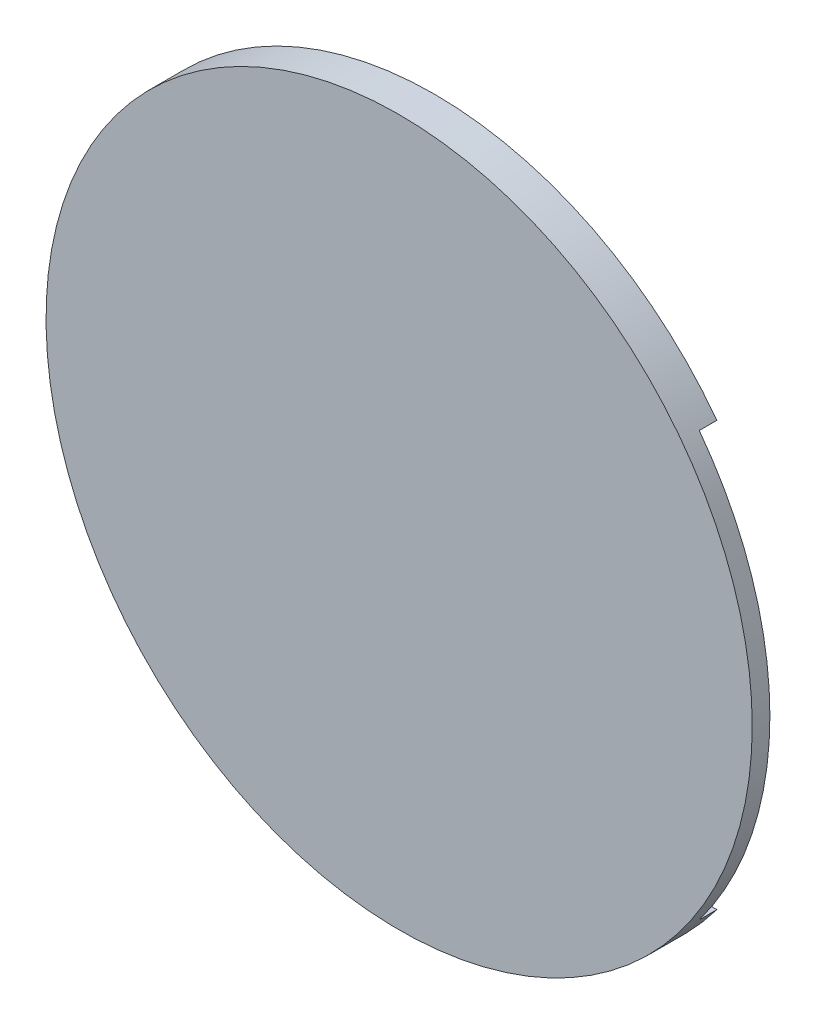
ISO-10303-21;
HEADER;
FILE_DESCRIPTION(('STEP AP214'),'2;1');
FILE_NAME('part.step','',(''),(''),'','','');
FILE_SCHEMA(('AUTOMOTIVE_DESIGN { 1 0 10303 214 1 1 1 1 }'));
ENDSEC;
DATA;
#1=APPLICATION_CONTEXT('core data for automotive mechanical design processes');
#2=APPLICATION_PROTOCOL_DEFINITION('international standard','automotive_design',2000,#1);
#3=PRODUCT_CONTEXT('',#1,'mechanical');
#4=PRODUCT('Part','Part','',(#3));
#5=PRODUCT_RELATED_PRODUCT_CATEGORY('part','',(#4));
#6=PRODUCT_DEFINITION_FORMATION('','',#4);
#7=PRODUCT_DEFINITION_CONTEXT('part definition',#1,'design');
#8=PRODUCT_DEFINITION('design','',#6,#7);
#9=PRODUCT_DEFINITION_SHAPE('','',#8);
#10=(LENGTH_UNIT() NAMED_UNIT(*) SI_UNIT(.MILLI.,.METRE.));
#11=(NAMED_UNIT(*) PLANE_ANGLE_UNIT() SI_UNIT($,.RADIAN.));
#12=(NAMED_UNIT(*) SI_UNIT($,.STERADIAN.) SOLID_ANGLE_UNIT());
#13=UNCERTAINTY_MEASURE_WITH_UNIT(LENGTH_MEASURE(1.E-05),#10,'distance_accuracy_value','');
#14=(GEOMETRIC_REPRESENTATION_CONTEXT(3) GLOBAL_UNCERTAINTY_ASSIGNED_CONTEXT((#13)) GLOBAL_UNIT_ASSIGNED_CONTEXT((#10,
#11,#12)) REPRESENTATION_CONTEXT('',''));
#15=CARTESIAN_POINT('',(0.,0.,0.));
#16=DIRECTION('',(0.,0.,1.));
#17=DIRECTION('',(1.,0.,0.));
#18=AXIS2_PLACEMENT_3D('',#15,#16,#17);
#19=CARTESIAN_POINT('',(0.,0.,1.5875));
#20=DIRECTION('',(0.,0.,-1.));
#21=DIRECTION('',(-1.,0.,0.));
#22=AXIS2_PLACEMENT_3D('',#19,#20,#21);
#23=CYLINDRICAL_SURFACE('',#22,31.75);
#24=CARTESIAN_POINT('',(0.,0.,1.5875));
#25=DIRECTION('',(0.,0.,1.));
#26=DIRECTION('',(1.,0.,0.));
#27=AXIS2_PLACEMENT_3D('',#24,#25,#26);
#28=CIRCLE('',#27,31.75);
#29=CARTESIAN_POINT('',(31.75,0.,1.5875));
#30=VERTEX_POINT('',#29);
#31=EDGE_CURVE('E83',#30,#30,#28,.T.);
#32=ORIENTED_EDGE('',*,*,#31,.F.);
#33=EDGE_LOOP('',(#32));
#34=FACE_BOUND('',#33,.T.);
#35=DIRECTION('',(0.,0.,-1.));
#36=VECTOR('',#35,1.);
#37=CARTESIAN_POINT('',(25.4,-19.05,1.5875));
#38=LINE('',#37,#36);
#39=CARTESIAN_POINT('',(25.4,-19.05,0.));
#40=VERTEX_POINT('',#39);
#41=CARTESIAN_POINT('',(25.4,-19.05,-1.5875));
#42=VERTEX_POINT('',#41);
#43=EDGE_CURVE('E57',#40,#42,#38,.T.);
#44=ORIENTED_EDGE('',*,*,#43,.F.);
#45=CARTESIAN_POINT('',(0.,0.,0.));
#46=DIRECTION('',(0.,0.,1.));
#47=DIRECTION('',(0.,-1.,0.));
#48=AXIS2_PLACEMENT_3D('',#45,#46,#47);
#49=CIRCLE('',#48,31.75);
#50=CARTESIAN_POINT('',(25.4,19.05,0.));
#51=VERTEX_POINT('',#50);
#52=EDGE_CURVE('E38',#40,#51,#49,.T.);
#53=ORIENTED_EDGE('',*,*,#52,.T.);
#54=DIRECTION('',(0.,0.,-1.));
#55=VECTOR('',#54,1.);
#56=CARTESIAN_POINT('',(25.4,19.05,1.5875));
#57=LINE('',#56,#55);
#58=CARTESIAN_POINT('',(25.4,19.05,-1.5875));
#59=VERTEX_POINT('',#58);
#60=EDGE_CURVE('E77',#51,#59,#57,.T.);
#61=ORIENTED_EDGE('',*,*,#60,.T.);
#62=CARTESIAN_POINT('',(0.,0.,-1.5875));
#63=DIRECTION('',(0.,0.,1.));
#64=DIRECTION('',(1.,0.,0.));
#65=AXIS2_PLACEMENT_3D('',#62,#63,#64);
#66=CIRCLE('',#65,31.75);
#67=CARTESIAN_POINT('',(-25.4,19.05,-1.5875));
#68=VERTEX_POINT('',#67);
#69=EDGE_CURVE('E87',#59,#68,#66,.T.);
#70=ORIENTED_EDGE('',*,*,#69,.T.);
#71=DIRECTION('',(0.,0.,-1.));
#72=VECTOR('',#71,1.);
#73=CARTESIAN_POINT('',(-25.4,19.05,1.5875));
#74=LINE('',#73,#72);
#75=CARTESIAN_POINT('',(-25.4,19.05,0.));
#76=VERTEX_POINT('',#75);
#77=EDGE_CURVE('E49',#68,#76,#74,.F.);
#78=ORIENTED_EDGE('',*,*,#77,.T.);
#79=CARTESIAN_POINT('',(-25.4,-19.05,0.));
#80=VERTEX_POINT('',#79);
#81=EDGE_CURVE('E11',#76,#80,#49,.T.);
#82=ORIENTED_EDGE('',*,*,#81,.T.);
#83=DIRECTION('',(0.,0.,-1.));
#84=VECTOR('',#83,1.);
#85=CARTESIAN_POINT('',(-25.4,-19.05,1.5875));
#86=LINE('',#85,#84);
#87=CARTESIAN_POINT('',(-25.4,-19.05,-1.5875));
#88=VERTEX_POINT('',#87);
#89=EDGE_CURVE('E88',#88,#80,#86,.F.);
#90=ORIENTED_EDGE('',*,*,#89,.F.);
#91=EDGE_CURVE('E91',#88,#42,#66,.T.);
#92=ORIENTED_EDGE('',*,*,#91,.T.);
#93=EDGE_LOOP('',(#44,#53,#61,#70,#78,#82,#90,#92));
#94=FACE_BOUND('',#93,.T.);
#95=ADVANCED_FACE('F35',(#34,#94),#23,.T.);
#96=CARTESIAN_POINT('',(0.,0.,-1.5875));
#97=DIRECTION('',(0.,0.,1.));
#98=DIRECTION('',(1.,0.,0.));
#99=AXIS2_PLACEMENT_3D('',#96,#97,#98);
#100=PLANE('',#99);
#101=DIRECTION('',(-1.,0.,0.));
#102=VECTOR('',#101,1.);
#103=CARTESIAN_POINT('',(0.,-19.05,-1.5875));
#104=LINE('',#103,#102);
#105=EDGE_CURVE('E82',#42,#88,#104,.T.);
#106=ORIENTED_EDGE('',*,*,#105,.F.);
#107=ORIENTED_EDGE('',*,*,#91,.F.);
#108=EDGE_LOOP('',(#106,#107));
#109=FACE_BOUND('',#108,.T.);
#110=ADVANCED_FACE('F103',(#109),#100,.F.);
#111=CARTESIAN_POINT('',(0.,0.,1.5875));
#112=DIRECTION('',(0.,0.,1.));
#113=DIRECTION('',(1.,0.,0.));
#114=AXIS2_PLACEMENT_3D('',#111,#112,#113);
#115=PLANE('',#114);
#116=ORIENTED_EDGE('',*,*,#31,.T.);
#117=EDGE_LOOP('',(#116));
#118=FACE_BOUND('',#117,.T.);
#119=ADVANCED_FACE('F105',(#118),#115,.T.);
#120=ORIENTED_EDGE('',*,*,#69,.F.);
#121=DIRECTION('',(-1.,0.,0.));
#122=VECTOR('',#121,1.);
#123=CARTESIAN_POINT('',(0.,19.05,-1.5875));
#124=LINE('',#123,#122);
#125=EDGE_CURVE('E74',#59,#68,#124,.T.);
#126=ORIENTED_EDGE('',*,*,#125,.T.);
#127=EDGE_LOOP('',(#120,#126));
#128=FACE_BOUND('',#127,.T.);
#129=ADVANCED_FACE('F90',(#128),#100,.F.);
#130=CARTESIAN_POINT('',(-31.75,0.,0.));
#131=DIRECTION('',(0.,0.,1.));
#132=DIRECTION('',(0.,-1.,0.));
#133=AXIS2_PLACEMENT_3D('',#130,#131,#132);
#134=PLANE('',#133);
#135=DIRECTION('',(1.,0.,0.));
#136=VECTOR('',#135,1.);
#137=CARTESIAN_POINT('',(-31.75,-19.05,0.));
#138=LINE('',#137,#136);
#139=EDGE_CURVE('E168',#80,#40,#138,.T.);
#140=ORIENTED_EDGE('',*,*,#139,.F.);
#141=ORIENTED_EDGE('',*,*,#81,.F.);
#142=DIRECTION('',(1.,0.,0.));
#143=VECTOR('',#142,1.);
#144=CARTESIAN_POINT('',(-31.75,19.05,0.));
#145=LINE('',#144,#143);
#146=EDGE_CURVE('E169',#76,#51,#145,.T.);
#147=ORIENTED_EDGE('',*,*,#146,.T.);
#148=ORIENTED_EDGE('',*,*,#52,.F.);
#149=EDGE_LOOP('',(#140,#141,#147,#148));
#150=FACE_BOUND('',#149,.T.);
#151=ADVANCED_FACE('F114',(#150),#134,.F.);
#152=CARTESIAN_POINT('',(-31.75,-19.05,0.));
#153=DIRECTION('',(0.,1.,0.));
#154=DIRECTION('',(0.,0.,1.));
#155=AXIS2_PLACEMENT_3D('',#152,#153,#154);
#156=PLANE('',#155);
#157=ORIENTED_EDGE('',*,*,#43,.T.);
#158=ORIENTED_EDGE('',*,*,#105,.T.);
#159=ORIENTED_EDGE('',*,*,#89,.T.);
#160=ORIENTED_EDGE('',*,*,#139,.T.);
#161=EDGE_LOOP('',(#157,#158,#159,#160));
#162=FACE_BOUND('',#161,.T.);
#163=ADVANCED_FACE('F98',(#162),#156,.T.);
#164=CARTESIAN_POINT('',(-31.75,19.05,0.));
#165=DIRECTION('',(0.,1.,0.));
#166=DIRECTION('',(0.,0.,1.));
#167=AXIS2_PLACEMENT_3D('',#164,#165,#166);
#168=PLANE('',#167);
#169=ORIENTED_EDGE('',*,*,#146,.F.);
#170=ORIENTED_EDGE('',*,*,#77,.F.);
#171=ORIENTED_EDGE('',*,*,#125,.F.);
#172=ORIENTED_EDGE('',*,*,#60,.F.);
#173=EDGE_LOOP('',(#169,#170,#171,#172));
#174=FACE_BOUND('',#173,.T.);
#175=ADVANCED_FACE('F76',(#174),#168,.F.);
#176=CLOSED_SHELL('',(#95,#110,#119,#129,#151,#163,#175));
#177=MANIFOLD_SOLID_BREP('B2',#176);
#178=ADVANCED_BREP_SHAPE_REPRESENTATION('',(#18,#177),#14);
#179=SHAPE_DEFINITION_REPRESENTATION(#9,#178);
ENDSEC;
END-ISO-10303-21;
